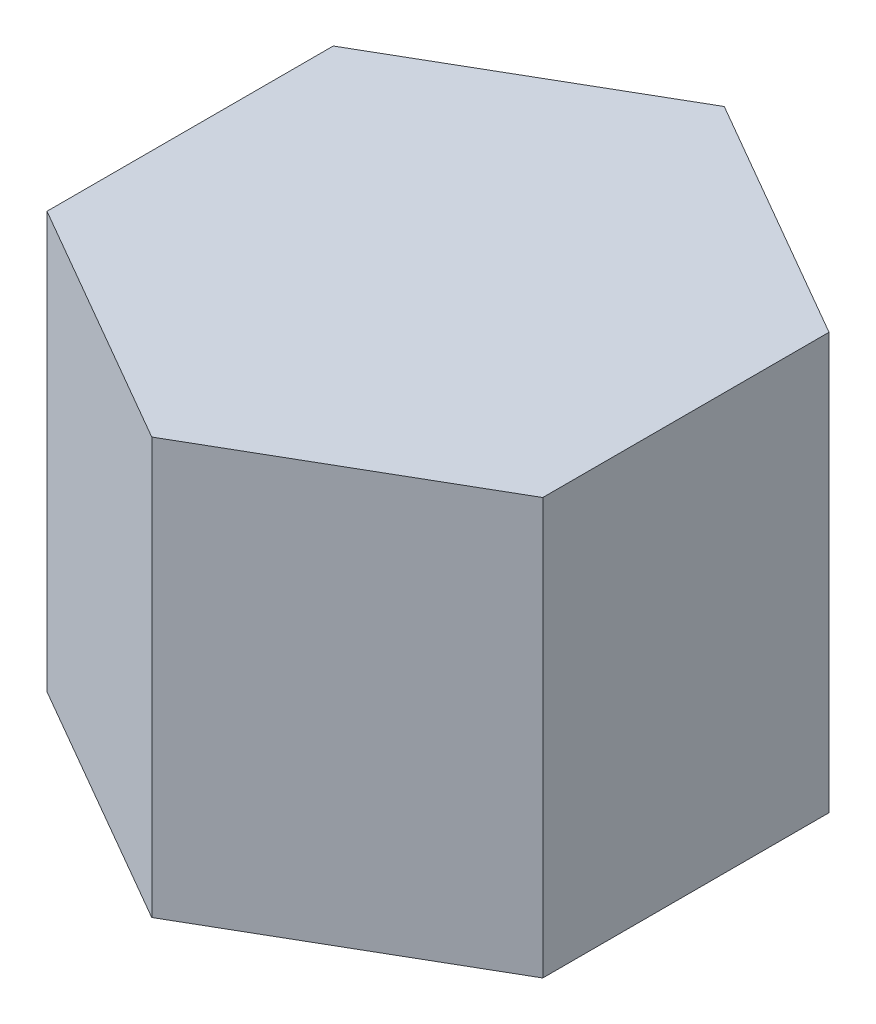
ISO-10303-21;
HEADER;
FILE_DESCRIPTION(('STEP AP214'),'2;1');
FILE_NAME('part.step','',(''),(''),'','','');
FILE_SCHEMA(('AUTOMOTIVE_DESIGN { 1 0 10303 214 1 1 1 1 }'));
ENDSEC;
DATA;
#1=APPLICATION_CONTEXT('core data for automotive mechanical design processes');
#2=APPLICATION_PROTOCOL_DEFINITION('international standard','automotive_design',2000,#1);
#3=PRODUCT_CONTEXT('',#1,'mechanical');
#4=PRODUCT('Part','Part','',(#3));
#5=PRODUCT_RELATED_PRODUCT_CATEGORY('part','',(#4));
#6=PRODUCT_DEFINITION_FORMATION('','',#4);
#7=PRODUCT_DEFINITION_CONTEXT('part definition',#1,'design');
#8=PRODUCT_DEFINITION('design','',#6,#7);
#9=PRODUCT_DEFINITION_SHAPE('','',#8);
#10=(LENGTH_UNIT() NAMED_UNIT(*) SI_UNIT(.MILLI.,.METRE.));
#11=(NAMED_UNIT(*) PLANE_ANGLE_UNIT() SI_UNIT($,.RADIAN.));
#12=(NAMED_UNIT(*) SI_UNIT($,.STERADIAN.) SOLID_ANGLE_UNIT());
#13=UNCERTAINTY_MEASURE_WITH_UNIT(LENGTH_MEASURE(1.E-05),#10,'distance_accuracy_value','');
#14=(GEOMETRIC_REPRESENTATION_CONTEXT(3) GLOBAL_UNCERTAINTY_ASSIGNED_CONTEXT((#13)) GLOBAL_UNIT_ASSIGNED_CONTEXT((#10,
#11,#12)) REPRESENTATION_CONTEXT('',''));
#15=CARTESIAN_POINT('',(0.,0.,0.));
#16=DIRECTION('',(0.,0.,1.));
#17=DIRECTION('',(1.,0.,0.));
#18=AXIS2_PLACEMENT_3D('',#15,#16,#17);
#19=CARTESIAN_POINT('',(208.839551417382,-147.556598747966,287.351844201572));
#20=DIRECTION('',(-0.499999999999978,0.,-0.866025403784452));
#21=DIRECTION('',(-0.866025403784452,0.,0.499999999999978));
#22=AXIS2_PLACEMENT_3D('',#19,#20,#21);
#23=PLANE('',#22);
#24=CARTESIAN_POINT('',(209.142660308706,-147.047793579175,287.176844201572));
#25=DIRECTION('',(-0.866025403784452,0.,0.499999999999978));
#26=VECTOR('',#25,1.);
#27=LINE('',#24,#26);
#28=CARTESIAN_POINT('',(209.142660308706,-147.047793579175,287.176844201572));
#29=VERTEX_POINT('',#28);
#30=CARTESIAN_POINT('',(208.839551417382,-147.047793579175,287.351844201572));
#31=VERTEX_POINT('',#30);
#32=EDGE_CURVE('E170',#29,#31,#27,.T.);
#33=ORIENTED_EDGE('',*,*,#32,.T.);
#34=CARTESIAN_POINT('',(208.839551417382,-147.556598747966,287.351844201572));
#35=DIRECTION('',(0.,1.,0.));
#36=VECTOR('',#35,1.);
#37=LINE('',#34,#36);
#38=CARTESIAN_POINT('',(208.839551417382,-147.556598747966,287.351844201572));
#39=VERTEX_POINT('',#38);
#40=EDGE_CURVE('E35',#39,#31,#37,.T.);
#41=ORIENTED_EDGE('',*,*,#40,.F.);
#42=CARTESIAN_POINT('',(209.142660308706,-147.556598747966,287.176844201572));
#43=DIRECTION('',(-0.866025403784452,0.,0.499999999999978));
#44=VECTOR('',#43,1.);
#45=LINE('',#42,#44);
#46=CARTESIAN_POINT('',(209.142660308706,-147.556598747966,287.176844201572));
#47=VERTEX_POINT('',#46);
#48=EDGE_CURVE('E159',#47,#39,#45,.T.);
#49=ORIENTED_EDGE('',*,*,#48,.F.);
#50=CARTESIAN_POINT('',(209.142660308706,-147.556598747966,287.176844201572));
#51=DIRECTION('',(0.,1.,0.));
#52=VECTOR('',#51,1.);
#53=LINE('',#50,#52);
#54=EDGE_CURVE('E10',#47,#29,#53,.T.);
#55=ORIENTED_EDGE('',*,*,#54,.T.);
#56=EDGE_LOOP('',(#33,#41,#49,#55));
#57=FACE_BOUND('',#56,.T.);
#58=ADVANCED_FACE('F16',(#57),#23,.F.);
#59=CARTESIAN_POINT('',(209.142660308706,-147.556598747966,291.594471220494));
#60=DIRECTION('',(-1.,0.,0.));
#61=DIRECTION('',(0.,-1.,0.));
#62=AXIS2_PLACEMENT_3D('',#59,#60,#61);
#63=PLANE('',#62);
#64=CARTESIAN_POINT('',(209.142660308706,-147.047793579175,286.826844201572));
#65=DIRECTION('',(0.,0.,1.));
#66=VECTOR('',#65,1.);
#67=LINE('',#64,#66);
#68=CARTESIAN_POINT('',(209.142660308706,-147.047793579175,286.826844201572));
#69=VERTEX_POINT('',#68);
#70=EDGE_CURVE('E167',#69,#29,#67,.T.);
#71=ORIENTED_EDGE('',*,*,#70,.T.);
#72=ORIENTED_EDGE('',*,*,#54,.F.);
#73=CARTESIAN_POINT('',(209.142660308706,-147.556598747966,286.826844201572));
#74=DIRECTION('',(0.,0.,1.));
#75=VECTOR('',#74,1.);
#76=LINE('',#73,#75);
#77=CARTESIAN_POINT('',(209.142660308706,-147.556598747966,286.826844201572));
#78=VERTEX_POINT('',#77);
#79=EDGE_CURVE('E156',#78,#47,#76,.T.);
#80=ORIENTED_EDGE('',*,*,#79,.F.);
#81=CARTESIAN_POINT('',(209.142660308706,-147.556598747966,286.826844201572));
#82=DIRECTION('',(0.,1.,0.));
#83=VECTOR('',#82,1.);
#84=LINE('',#81,#83);
#85=EDGE_CURVE('E27',#78,#69,#84,.T.);
#86=ORIENTED_EDGE('',*,*,#85,.T.);
#87=EDGE_LOOP('',(#71,#72,#80,#86));
#88=FACE_BOUND('',#87,.T.);
#89=ADVANCED_FACE('F189',(#88),#63,.F.);
#90=CARTESIAN_POINT('',(209.142660308706,-147.556598747966,286.826844201572));
#91=DIRECTION('',(-0.499999999999943,0.,0.866025403784471));
#92=DIRECTION('',(0.866025403784471,0.,0.499999999999943));
#93=AXIS2_PLACEMENT_3D('',#90,#91,#92);
#94=PLANE('',#93);
#95=CARTESIAN_POINT('',(208.839551417382,-147.047793579175,286.651844201572));
#96=DIRECTION('',(0.866025403784471,0.,0.499999999999943));
#97=VECTOR('',#96,1.);
#98=LINE('',#95,#97);
#99=CARTESIAN_POINT('',(208.839551417382,-147.047793579175,286.651844201572));
#100=VERTEX_POINT('',#99);
#101=EDGE_CURVE('E163',#100,#69,#98,.T.);
#102=ORIENTED_EDGE('',*,*,#101,.T.);
#103=ORIENTED_EDGE('',*,*,#85,.F.);
#104=CARTESIAN_POINT('',(208.839551417382,-147.556598747966,286.651844201572));
#105=DIRECTION('',(0.866025403784471,0.,0.499999999999943));
#106=VECTOR('',#105,1.);
#107=LINE('',#104,#106);
#108=CARTESIAN_POINT('',(208.839551417382,-147.556598747966,286.651844201572));
#109=VERTEX_POINT('',#108);
#110=EDGE_CURVE('E106',#109,#78,#107,.T.);
#111=ORIENTED_EDGE('',*,*,#110,.F.);
#112=CARTESIAN_POINT('',(208.839551417382,-147.556598747966,286.651844201572));
#113=DIRECTION('',(0.,1.,0.));
#114=VECTOR('',#113,1.);
#115=LINE('',#112,#114);
#116=EDGE_CURVE('E94',#109,#100,#115,.T.);
#117=ORIENTED_EDGE('',*,*,#116,.T.);
#118=EDGE_LOOP('',(#102,#103,#111,#117));
#119=FACE_BOUND('',#118,.T.);
#120=ADVANCED_FACE('F198',(#119),#94,.F.);
#121=CARTESIAN_POINT('',(208.839551417382,-147.556598747966,286.651844201572));
#122=DIRECTION('',(0.499999999999978,0.,0.866025403784452));
#123=DIRECTION('',(0.866025403784452,0.,-0.499999999999978));
#124=AXIS2_PLACEMENT_3D('',#121,#122,#123);
#125=PLANE('',#124);
#126=CARTESIAN_POINT('',(208.536442526057,-147.047793579175,286.826844201572));
#127=DIRECTION('',(0.866025403784452,0.,-0.499999999999978));
#128=VECTOR('',#127,1.);
#129=LINE('',#126,#128);
#130=CARTESIAN_POINT('',(208.536442526057,-147.047793579175,286.826844201572));
#131=VERTEX_POINT('',#130);
#132=EDGE_CURVE('E162',#131,#100,#129,.T.);
#133=ORIENTED_EDGE('',*,*,#132,.T.);
#134=ORIENTED_EDGE('',*,*,#116,.F.);
#135=CARTESIAN_POINT('',(208.536442526057,-147.556598747966,286.826844201572));
#136=DIRECTION('',(0.866025403784452,0.,-0.499999999999978));
#137=VECTOR('',#136,1.);
#138=LINE('',#135,#137);
#139=CARTESIAN_POINT('',(208.536442526057,-147.556598747966,286.826844201572));
#140=VERTEX_POINT('',#139);
#141=EDGE_CURVE('E98',#140,#109,#138,.T.);
#142=ORIENTED_EDGE('',*,*,#141,.F.);
#143=CARTESIAN_POINT('',(208.536442526057,-147.556598747966,286.826844201572));
#144=DIRECTION('',(0.,1.,0.));
#145=VECTOR('',#144,1.);
#146=LINE('',#143,#145);
#147=EDGE_CURVE('E79',#140,#131,#146,.T.);
#148=ORIENTED_EDGE('',*,*,#147,.T.);
#149=EDGE_LOOP('',(#133,#134,#142,#148));
#150=FACE_BOUND('',#149,.T.);
#151=ADVANCED_FACE('F100',(#150),#125,.F.);
#152=CARTESIAN_POINT('',(208.536442526057,-147.556598747966,291.594471220494));
#153=DIRECTION('',(1.,0.,0.));
#154=DIRECTION('',(0.,1.,0.));
#155=AXIS2_PLACEMENT_3D('',#152,#153,#154);
#156=PLANE('',#155);
#157=CARTESIAN_POINT('',(208.536442526057,-147.047793579175,287.176844201572));
#158=DIRECTION('',(0.,0.,-1.));
#159=VECTOR('',#158,1.);
#160=LINE('',#157,#159);
#161=CARTESIAN_POINT('',(208.536442526057,-147.047793579175,287.176844201572));
#162=VERTEX_POINT('',#161);
#163=EDGE_CURVE('E88',#162,#131,#160,.T.);
#164=ORIENTED_EDGE('',*,*,#163,.T.);
#165=ORIENTED_EDGE('',*,*,#147,.F.);
#166=CARTESIAN_POINT('',(208.536442526057,-147.556598747966,287.176844201572));
#167=DIRECTION('',(0.,0.,-1.));
#168=VECTOR('',#167,1.);
#169=LINE('',#166,#168);
#170=CARTESIAN_POINT('',(208.536442526057,-147.556598747966,287.176844201572));
#171=VERTEX_POINT('',#170);
#172=EDGE_CURVE('E84',#171,#140,#169,.T.);
#173=ORIENTED_EDGE('',*,*,#172,.F.);
#174=CARTESIAN_POINT('',(208.536442526057,-147.556598747966,287.176844201572));
#175=DIRECTION('',(0.,1.,0.));
#176=VECTOR('',#175,1.);
#177=LINE('',#174,#176);
#178=EDGE_CURVE('E58',#171,#162,#177,.T.);
#179=ORIENTED_EDGE('',*,*,#178,.T.);
#180=EDGE_LOOP('',(#164,#165,#173,#179));
#181=FACE_BOUND('',#180,.T.);
#182=ADVANCED_FACE('F82',(#181),#156,.F.);
#183=CARTESIAN_POINT('',(208.536442526057,-147.556598747966,287.176844201572));
#184=DIRECTION('',(0.499999999999943,0.,-0.866025403784471));
#185=DIRECTION('',(-0.866025403784471,0.,-0.499999999999943));
#186=AXIS2_PLACEMENT_3D('',#183,#184,#185);
#187=PLANE('',#186);
#188=CARTESIAN_POINT('',(208.839551417382,-147.047793579175,287.351844201572));
#189=DIRECTION('',(-0.866025403784471,0.,-0.499999999999943));
#190=VECTOR('',#189,1.);
#191=LINE('',#188,#190);
#192=EDGE_CURVE('E160',#31,#162,#191,.T.);
#193=ORIENTED_EDGE('',*,*,#192,.T.);
#194=ORIENTED_EDGE('',*,*,#178,.F.);
#195=CARTESIAN_POINT('',(208.839551417382,-147.556598747966,287.351844201572));
#196=DIRECTION('',(-0.866025403784471,0.,-0.499999999999943));
#197=VECTOR('',#196,1.);
#198=LINE('',#195,#197);
#199=EDGE_CURVE('E112',#39,#171,#198,.T.);
#200=ORIENTED_EDGE('',*,*,#199,.F.);
#201=ORIENTED_EDGE('',*,*,#40,.T.);
#202=EDGE_LOOP('',(#193,#194,#200,#201));
#203=FACE_BOUND('',#202,.T.);
#204=ADVANCED_FACE('F131',(#203),#187,.F.);
#205=CARTESIAN_POINT('',(206.491105863044,-147.556598747966,291.594471220494));
#206=DIRECTION('',(0.,1.,0.));
#207=DIRECTION('',(-1.,0.,0.));
#208=AXIS2_PLACEMENT_3D('',#205,#206,#207);
#209=PLANE('',#208);
#210=ORIENTED_EDGE('',*,*,#48,.T.);
#211=ORIENTED_EDGE('',*,*,#199,.T.);
#212=ORIENTED_EDGE('',*,*,#172,.T.);
#213=ORIENTED_EDGE('',*,*,#141,.T.);
#214=ORIENTED_EDGE('',*,*,#110,.T.);
#215=ORIENTED_EDGE('',*,*,#79,.T.);
#216=EDGE_LOOP('',(#210,#211,#212,#213,#214,#215));
#217=FACE_BOUND('',#216,.T.);
#218=ADVANCED_FACE('F111',(#217),#209,.F.);
#219=CARTESIAN_POINT('',(206.491105863044,-147.047793579175,291.594471220494));
#220=DIRECTION('',(0.,1.,0.));
#221=DIRECTION('',(-1.,0.,0.));
#222=AXIS2_PLACEMENT_3D('',#219,#220,#221);
#223=PLANE('',#222);
#224=ORIENTED_EDGE('',*,*,#32,.F.);
#225=ORIENTED_EDGE('',*,*,#70,.F.);
#226=ORIENTED_EDGE('',*,*,#101,.F.);
#227=ORIENTED_EDGE('',*,*,#132,.F.);
#228=ORIENTED_EDGE('',*,*,#163,.F.);
#229=ORIENTED_EDGE('',*,*,#192,.F.);
#230=EDGE_LOOP('',(#224,#225,#226,#227,#228,#229));
#231=FACE_BOUND('',#230,.T.);
#232=ADVANCED_FACE('F130',(#231),#223,.T.);
#233=CLOSED_SHELL('',(#58,#89,#120,#151,#182,#204,#218,#232));
#234=MANIFOLD_SOLID_BREP('B1',#233);
#235=ADVANCED_BREP_SHAPE_REPRESENTATION('',(#18,#234),#14);
#236=SHAPE_DEFINITION_REPRESENTATION(#9,#235);
ENDSEC;
END-ISO-10303-21;
